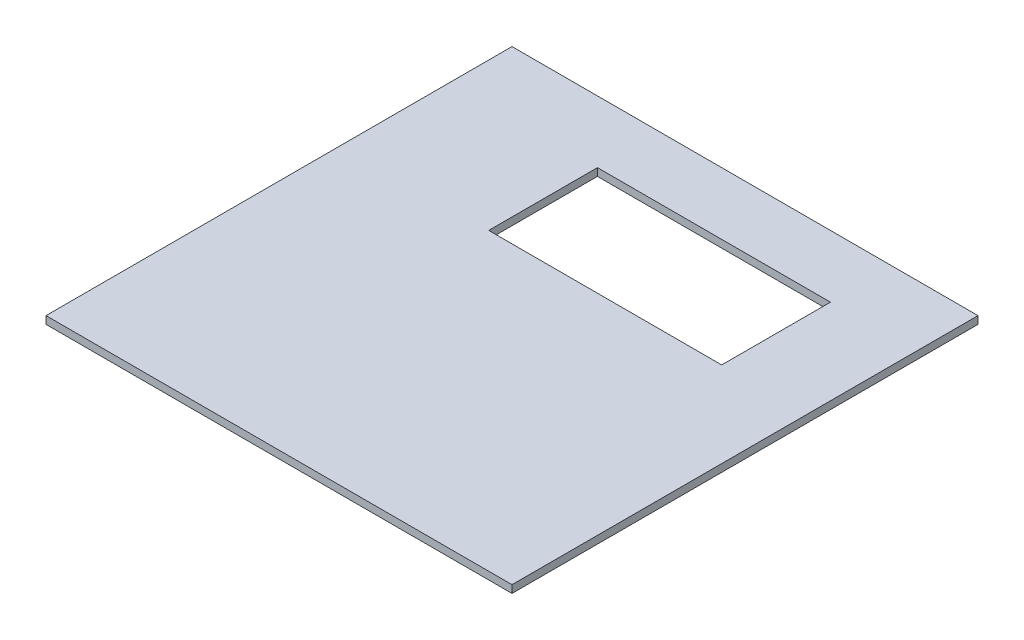
ISO-10303-21;
HEADER;
FILE_DESCRIPTION(('STEP AP214'),'2;1');
FILE_NAME('part.step','',(''),(''),'','','');
FILE_SCHEMA(('AUTOMOTIVE_DESIGN { 1 0 10303 214 1 1 1 1 }'));
ENDSEC;
DATA;
#1=APPLICATION_CONTEXT('core data for automotive mechanical design processes');
#2=APPLICATION_PROTOCOL_DEFINITION('international standard','automotive_design',2000,#1);
#3=PRODUCT_CONTEXT('',#1,'mechanical');
#4=PRODUCT('Part','Part','',(#3));
#5=PRODUCT_RELATED_PRODUCT_CATEGORY('part','',(#4));
#6=PRODUCT_DEFINITION_FORMATION('','',#4);
#7=PRODUCT_DEFINITION_CONTEXT('part definition',#1,'design');
#8=PRODUCT_DEFINITION('design','',#6,#7);
#9=PRODUCT_DEFINITION_SHAPE('','',#8);
#10=(LENGTH_UNIT() NAMED_UNIT(*) SI_UNIT(.MILLI.,.METRE.));
#11=(NAMED_UNIT(*) PLANE_ANGLE_UNIT() SI_UNIT($,.RADIAN.));
#12=(NAMED_UNIT(*) SI_UNIT($,.STERADIAN.) SOLID_ANGLE_UNIT());
#13=UNCERTAINTY_MEASURE_WITH_UNIT(LENGTH_MEASURE(1.E-05),#10,'distance_accuracy_value','');
#14=(GEOMETRIC_REPRESENTATION_CONTEXT(3) GLOBAL_UNCERTAINTY_ASSIGNED_CONTEXT((#13)) GLOBAL_UNIT_ASSIGNED_CONTEXT((#10,
#11,#12)) REPRESENTATION_CONTEXT('',''));
#15=CARTESIAN_POINT('',(0.,0.,0.));
#16=DIRECTION('',(0.,0.,1.));
#17=DIRECTION('',(1.,0.,0.));
#18=AXIS2_PLACEMENT_3D('',#15,#16,#17);
#19=CARTESIAN_POINT('',(0.,6.223,0.));
#20=DIRECTION('',(1.,0.,0.));
#21=DIRECTION('',(0.,0.,-1.));
#22=AXIS2_PLACEMENT_3D('',#19,#20,#21);
#23=PLANE('',#22);
#24=DIRECTION('',(0.,0.,1.));
#25=VECTOR('',#24,1.);
#26=CARTESIAN_POINT('',(0.,0.,0.));
#27=LINE('',#26,#25);
#28=CARTESIAN_POINT('',(0.,0.,-381.));
#29=VERTEX_POINT('',#28);
#30=CARTESIAN_POINT('',(0.,0.,0.));
#31=VERTEX_POINT('',#30);
#32=EDGE_CURVE('E122',#29,#31,#27,.T.);
#33=ORIENTED_EDGE('',*,*,#32,.T.);
#34=DIRECTION('',(0.,-1.,0.));
#35=VECTOR('',#34,1.);
#36=CARTESIAN_POINT('',(0.,6.223,0.));
#37=LINE('',#36,#35);
#38=CARTESIAN_POINT('',(0.,6.223,0.));
#39=VERTEX_POINT('',#38);
#40=EDGE_CURVE('E151',#39,#31,#37,.T.);
#41=ORIENTED_EDGE('',*,*,#40,.F.);
#42=DIRECTION('',(0.,0.,1.));
#43=VECTOR('',#42,1.);
#44=CARTESIAN_POINT('',(0.,6.223,0.));
#45=LINE('',#44,#43);
#46=CARTESIAN_POINT('',(0.,6.223,-381.));
#47=VERTEX_POINT('',#46);
#48=EDGE_CURVE('E125',#47,#39,#45,.T.);
#49=ORIENTED_EDGE('',*,*,#48,.F.);
#50=DIRECTION('',(0.,-1.,0.));
#51=VECTOR('',#50,1.);
#52=CARTESIAN_POINT('',(0.,6.223,-381.));
#53=LINE('',#52,#51);
#54=EDGE_CURVE('E135',#47,#29,#53,.T.);
#55=ORIENTED_EDGE('',*,*,#54,.T.);
#56=EDGE_LOOP('',(#33,#41,#49,#55));
#57=FACE_BOUND('',#56,.T.);
#58=ADVANCED_FACE('F33',(#57),#23,.F.);
#59=CARTESIAN_POINT('',(0.,6.223,0.));
#60=DIRECTION('',(0.,0.,-1.));
#61=DIRECTION('',(-1.,0.,0.));
#62=AXIS2_PLACEMENT_3D('',#59,#60,#61);
#63=PLANE('',#62);
#64=DIRECTION('',(1.,0.,0.));
#65=VECTOR('',#64,1.);
#66=CARTESIAN_POINT('',(0.,0.,0.));
#67=LINE('',#66,#65);
#68=CARTESIAN_POINT('',(381.,0.,0.));
#69=VERTEX_POINT('',#68);
#70=EDGE_CURVE('E138',#31,#69,#67,.T.);
#71=ORIENTED_EDGE('',*,*,#70,.T.);
#72=DIRECTION('',(0.,-1.,0.));
#73=VECTOR('',#72,1.);
#74=CARTESIAN_POINT('',(381.,6.223,0.));
#75=LINE('',#74,#73);
#76=CARTESIAN_POINT('',(381.,6.223,0.));
#77=VERTEX_POINT('',#76);
#78=EDGE_CURVE('E148',#77,#69,#75,.T.);
#79=ORIENTED_EDGE('',*,*,#78,.F.);
#80=DIRECTION('',(1.,0.,0.));
#81=VECTOR('',#80,1.);
#82=CARTESIAN_POINT('',(0.,6.223,0.));
#83=LINE('',#82,#81);
#84=EDGE_CURVE('E128',#39,#77,#83,.T.);
#85=ORIENTED_EDGE('',*,*,#84,.F.);
#86=ORIENTED_EDGE('',*,*,#40,.T.);
#87=EDGE_LOOP('',(#71,#79,#85,#86));
#88=FACE_BOUND('',#87,.T.);
#89=ADVANCED_FACE('F176',(#88),#63,.F.);
#90=CARTESIAN_POINT('',(381.,6.223,0.));
#91=DIRECTION('',(-1.,0.,0.));
#92=DIRECTION('',(0.,0.,1.));
#93=AXIS2_PLACEMENT_3D('',#90,#91,#92);
#94=PLANE('',#93);
#95=DIRECTION('',(0.,0.,-1.));
#96=VECTOR('',#95,1.);
#97=CARTESIAN_POINT('',(381.,0.,0.));
#98=LINE('',#97,#96);
#99=CARTESIAN_POINT('',(381.,0.,-381.));
#100=VERTEX_POINT('',#99);
#101=EDGE_CURVE('E140',#69,#100,#98,.T.);
#102=ORIENTED_EDGE('',*,*,#101,.T.);
#103=DIRECTION('',(0.,-1.,0.));
#104=VECTOR('',#103,1.);
#105=CARTESIAN_POINT('',(381.,6.223,-381.));
#106=LINE('',#105,#104);
#107=CARTESIAN_POINT('',(381.,6.223,-381.));
#108=VERTEX_POINT('',#107);
#109=EDGE_CURVE('E145',#108,#100,#106,.T.);
#110=ORIENTED_EDGE('',*,*,#109,.F.);
#111=DIRECTION('',(0.,0.,-1.));
#112=VECTOR('',#111,1.);
#113=CARTESIAN_POINT('',(381.,6.223,0.));
#114=LINE('',#113,#112);
#115=EDGE_CURVE('E131',#77,#108,#114,.T.);
#116=ORIENTED_EDGE('',*,*,#115,.F.);
#117=ORIENTED_EDGE('',*,*,#78,.T.);
#118=EDGE_LOOP('',(#102,#110,#116,#117));
#119=FACE_BOUND('',#118,.T.);
#120=ADVANCED_FACE('F181',(#119),#94,.F.);
#121=CARTESIAN_POINT('',(0.,6.223,-381.));
#122=DIRECTION('',(0.,0.,1.));
#123=DIRECTION('',(1.,0.,0.));
#124=AXIS2_PLACEMENT_3D('',#121,#122,#123);
#125=PLANE('',#124);
#126=DIRECTION('',(-1.,0.,0.));
#127=VECTOR('',#126,1.);
#128=CARTESIAN_POINT('',(0.,0.,-381.));
#129=LINE('',#128,#127);
#130=EDGE_CURVE('E129',#100,#29,#129,.T.);
#131=ORIENTED_EDGE('',*,*,#130,.T.);
#132=ORIENTED_EDGE('',*,*,#54,.F.);
#133=DIRECTION('',(-1.,0.,0.));
#134=VECTOR('',#133,1.);
#135=CARTESIAN_POINT('',(0.,6.223,-381.));
#136=LINE('',#135,#134);
#137=EDGE_CURVE('E133',#108,#47,#136,.T.);
#138=ORIENTED_EDGE('',*,*,#137,.F.);
#139=ORIENTED_EDGE('',*,*,#109,.T.);
#140=EDGE_LOOP('',(#131,#132,#138,#139));
#141=FACE_BOUND('',#140,.T.);
#142=ADVANCED_FACE('F194',(#141),#125,.F.);
#143=CARTESIAN_POINT('',(0.,6.223,0.));
#144=DIRECTION('',(0.,-1.,0.));
#145=DIRECTION('',(0.,0.,-1.));
#146=AXIS2_PLACEMENT_3D('',#143,#144,#145);
#147=PLANE('',#146);
#148=DIRECTION('',(1.,0.,0.));
#149=VECTOR('',#148,1.);
#150=CARTESIAN_POINT('',(120.65,6.223,-241.3));
#151=LINE('',#150,#149);
#152=CARTESIAN_POINT('',(120.65,6.223,-241.3));
#153=VERTEX_POINT('',#152);
#154=CARTESIAN_POINT('',(311.15,6.223,-241.3));
#155=VERTEX_POINT('',#154);
#156=EDGE_CURVE('E108',#153,#155,#151,.T.);
#157=ORIENTED_EDGE('',*,*,#156,.F.);
#158=DIRECTION('',(0.,0.,1.));
#159=VECTOR('',#158,1.);
#160=CARTESIAN_POINT('',(120.65,6.223,-330.2));
#161=LINE('',#160,#159);
#162=CARTESIAN_POINT('',(120.65,6.223,-330.2));
#163=VERTEX_POINT('',#162);
#164=EDGE_CURVE('E47',#163,#153,#161,.T.);
#165=ORIENTED_EDGE('',*,*,#164,.F.);
#166=DIRECTION('',(1.,0.,0.));
#167=VECTOR('',#166,1.);
#168=CARTESIAN_POINT('',(120.65,6.223,-330.2));
#169=LINE('',#168,#167);
#170=CARTESIAN_POINT('',(311.15,6.223,-330.2));
#171=VERTEX_POINT('',#170);
#172=EDGE_CURVE('E115',#163,#171,#169,.T.);
#173=ORIENTED_EDGE('',*,*,#172,.T.);
#174=DIRECTION('',(0.,0.,1.));
#175=VECTOR('',#174,1.);
#176=CARTESIAN_POINT('',(311.15,6.223,-330.2));
#177=LINE('',#176,#175);
#178=EDGE_CURVE('E99',#171,#155,#177,.T.);
#179=ORIENTED_EDGE('',*,*,#178,.T.);
#180=EDGE_LOOP('',(#157,#165,#173,#179));
#181=FACE_BOUND('',#180,.T.);
#182=ORIENTED_EDGE('',*,*,#48,.T.);
#183=ORIENTED_EDGE('',*,*,#84,.T.);
#184=ORIENTED_EDGE('',*,*,#115,.T.);
#185=ORIENTED_EDGE('',*,*,#137,.T.);
#186=EDGE_LOOP('',(#182,#183,#184,#185));
#187=FACE_BOUND('',#186,.T.);
#188=ADVANCED_FACE('F112',(#181,#187),#147,.F.);
#189=CARTESIAN_POINT('',(0.,0.,0.));
#190=DIRECTION('',(0.,-1.,0.));
#191=DIRECTION('',(0.,0.,-1.));
#192=AXIS2_PLACEMENT_3D('',#189,#190,#191);
#193=PLANE('',#192);
#194=DIRECTION('',(0.,0.,-1.));
#195=VECTOR('',#194,1.);
#196=CARTESIAN_POINT('',(120.65,0.,0.));
#197=LINE('',#196,#195);
#198=CARTESIAN_POINT('',(120.65,0.,-241.3));
#199=VERTEX_POINT('',#198);
#200=CARTESIAN_POINT('',(120.65,0.,-330.2));
#201=VERTEX_POINT('',#200);
#202=EDGE_CURVE('E11',#199,#201,#197,.T.);
#203=ORIENTED_EDGE('',*,*,#202,.F.);
#204=DIRECTION('',(-1.,0.,0.));
#205=VECTOR('',#204,1.);
#206=CARTESIAN_POINT('',(0.,0.,-241.3));
#207=LINE('',#206,#205);
#208=CARTESIAN_POINT('',(311.15,0.,-241.3));
#209=VERTEX_POINT('',#208);
#210=EDGE_CURVE('E154',#209,#199,#207,.T.);
#211=ORIENTED_EDGE('',*,*,#210,.F.);
#212=DIRECTION('',(0.,0.,-1.));
#213=VECTOR('',#212,1.);
#214=CARTESIAN_POINT('',(311.15,0.,-1.94289029309402E-13));
#215=LINE('',#214,#213);
#216=CARTESIAN_POINT('',(311.15,0.,-330.2));
#217=VERTEX_POINT('',#216);
#218=EDGE_CURVE('E102',#209,#217,#215,.T.);
#219=ORIENTED_EDGE('',*,*,#218,.T.);
#220=DIRECTION('',(-1.,0.,0.));
#221=VECTOR('',#220,1.);
#222=CARTESIAN_POINT('',(0.,0.,-330.2));
#223=LINE('',#222,#221);
#224=EDGE_CURVE('E40',#217,#201,#223,.T.);
#225=ORIENTED_EDGE('',*,*,#224,.T.);
#226=EDGE_LOOP('',(#203,#211,#219,#225));
#227=FACE_BOUND('',#226,.T.);
#228=ORIENTED_EDGE('',*,*,#32,.F.);
#229=ORIENTED_EDGE('',*,*,#130,.F.);
#230=ORIENTED_EDGE('',*,*,#101,.F.);
#231=ORIENTED_EDGE('',*,*,#70,.F.);
#232=EDGE_LOOP('',(#228,#229,#230,#231));
#233=FACE_BOUND('',#232,.T.);
#234=ADVANCED_FACE('F159',(#227,#233),#193,.T.);
#235=CARTESIAN_POINT('',(120.65,-196.977,-330.2));
#236=DIRECTION('',(-1.,0.,0.));
#237=DIRECTION('',(0.,0.,1.));
#238=AXIS2_PLACEMENT_3D('',#235,#236,#237);
#239=PLANE('',#238);
#240=ORIENTED_EDGE('',*,*,#202,.T.);
#241=DIRECTION('',(0.,1.,0.));
#242=VECTOR('',#241,1.);
#243=CARTESIAN_POINT('',(120.65,-196.977,-330.2));
#244=LINE('',#243,#242);
#245=EDGE_CURVE('E120',#201,#163,#244,.T.);
#246=ORIENTED_EDGE('',*,*,#245,.T.);
#247=ORIENTED_EDGE('',*,*,#164,.T.);
#248=DIRECTION('',(0.,1.,0.));
#249=VECTOR('',#248,1.);
#250=CARTESIAN_POINT('',(120.65,-196.977,-241.3));
#251=LINE('',#250,#249);
#252=EDGE_CURVE('E105',#199,#153,#251,.T.);
#253=ORIENTED_EDGE('',*,*,#252,.F.);
#254=EDGE_LOOP('',(#240,#246,#247,#253));
#255=FACE_BOUND('',#254,.T.);
#256=ADVANCED_FACE('F164',(#255),#239,.F.);
#257=CARTESIAN_POINT('',(120.65,-196.977,-330.2));
#258=DIRECTION('',(0.,0.,1.));
#259=DIRECTION('',(1.,0.,0.));
#260=AXIS2_PLACEMENT_3D('',#257,#258,#259);
#261=PLANE('',#260);
#262=DIRECTION('',(0.,1.,0.));
#263=VECTOR('',#262,1.);
#264=CARTESIAN_POINT('',(311.15,-196.977,-330.2));
#265=LINE('',#264,#263);
#266=EDGE_CURVE('E104',#217,#171,#265,.T.);
#267=ORIENTED_EDGE('',*,*,#266,.T.);
#268=ORIENTED_EDGE('',*,*,#172,.F.);
#269=ORIENTED_EDGE('',*,*,#245,.F.);
#270=ORIENTED_EDGE('',*,*,#224,.F.);
#271=EDGE_LOOP('',(#267,#268,#269,#270));
#272=FACE_BOUND('',#271,.T.);
#273=ADVANCED_FACE('F163',(#272),#261,.T.);
#274=CARTESIAN_POINT('',(311.15,-196.977,-330.2));
#275=DIRECTION('',(-1.,0.,0.));
#276=DIRECTION('',(0.,0.,1.));
#277=AXIS2_PLACEMENT_3D('',#274,#275,#276);
#278=PLANE('',#277);
#279=DIRECTION('',(0.,1.,0.));
#280=VECTOR('',#279,1.);
#281=CARTESIAN_POINT('',(311.15,-196.977,-241.3));
#282=LINE('',#281,#280);
#283=EDGE_CURVE('E55',#209,#155,#282,.T.);
#284=ORIENTED_EDGE('',*,*,#283,.T.);
#285=ORIENTED_EDGE('',*,*,#178,.F.);
#286=ORIENTED_EDGE('',*,*,#266,.F.);
#287=ORIENTED_EDGE('',*,*,#218,.F.);
#288=EDGE_LOOP('',(#284,#285,#286,#287));
#289=FACE_BOUND('',#288,.T.);
#290=ADVANCED_FACE('F96',(#289),#278,.T.);
#291=CARTESIAN_POINT('',(120.65,-196.977,-241.3));
#292=DIRECTION('',(0.,0.,1.));
#293=DIRECTION('',(1.,0.,0.));
#294=AXIS2_PLACEMENT_3D('',#291,#292,#293);
#295=PLANE('',#294);
#296=ORIENTED_EDGE('',*,*,#210,.T.);
#297=ORIENTED_EDGE('',*,*,#252,.T.);
#298=ORIENTED_EDGE('',*,*,#156,.T.);
#299=ORIENTED_EDGE('',*,*,#283,.F.);
#300=EDGE_LOOP('',(#296,#297,#298,#299));
#301=FACE_BOUND('',#300,.T.);
#302=ADVANCED_FACE('F109',(#301),#295,.F.);
#303=CLOSED_SHELL('',(#58,#89,#120,#142,#188,#234,#256,#273,#290,#302));
#304=MANIFOLD_SOLID_BREP('B2',#303);
#305=ADVANCED_BREP_SHAPE_REPRESENTATION('',(#18,#304),#14);
#306=SHAPE_DEFINITION_REPRESENTATION(#9,#305);
ENDSEC;
END-ISO-10303-21;
